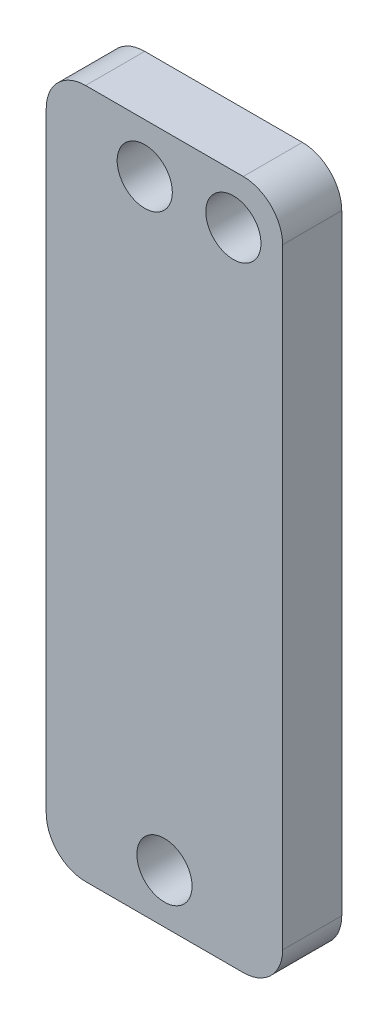
ISO-10303-21;
HEADER;
FILE_DESCRIPTION(('STEP AP214'),'2;1');
FILE_NAME('part.step','',(''),(''),'','','');
FILE_SCHEMA(('AUTOMOTIVE_DESIGN { 1 0 10303 214 1 1 1 1 }'));
ENDSEC;
DATA;
#1=APPLICATION_CONTEXT('core data for automotive mechanical design processes');
#2=APPLICATION_PROTOCOL_DEFINITION('international standard','automotive_design',2000,#1);
#3=PRODUCT_CONTEXT('',#1,'mechanical');
#4=PRODUCT('Part','Part','',(#3));
#5=PRODUCT_RELATED_PRODUCT_CATEGORY('part','',(#4));
#6=PRODUCT_DEFINITION_FORMATION('','',#4);
#7=PRODUCT_DEFINITION_CONTEXT('part definition',#1,'design');
#8=PRODUCT_DEFINITION('design','',#6,#7);
#9=PRODUCT_DEFINITION_SHAPE('','',#8);
#10=(LENGTH_UNIT() NAMED_UNIT(*) SI_UNIT(.MILLI.,.METRE.));
#11=(NAMED_UNIT(*) PLANE_ANGLE_UNIT() SI_UNIT($,.RADIAN.));
#12=(NAMED_UNIT(*) SI_UNIT($,.STERADIAN.) SOLID_ANGLE_UNIT());
#13=UNCERTAINTY_MEASURE_WITH_UNIT(LENGTH_MEASURE(1.E-05),#10,'distance_accuracy_value','');
#14=(GEOMETRIC_REPRESENTATION_CONTEXT(3) GLOBAL_UNCERTAINTY_ASSIGNED_CONTEXT((#13)) GLOBAL_UNIT_ASSIGNED_CONTEXT((#10,
#11,#12)) REPRESENTATION_CONTEXT('',''));
#15=CARTESIAN_POINT('',(0.,0.,0.));
#16=DIRECTION('',(0.,0.,1.));
#17=DIRECTION('',(1.,0.,0.));
#18=AXIS2_PLACEMENT_3D('',#15,#16,#17);
#19=CARTESIAN_POINT('',(0.,0.,3.));
#20=DIRECTION('',(0.,0.,1.));
#21=DIRECTION('',(1.,0.,0.));
#22=AXIS2_PLACEMENT_3D('',#19,#20,#21);
#23=PLANE('',#22);
#24=CARTESIAN_POINT('',(3.50000000000001,15.,3.));
#25=DIRECTION('',(0.,0.,-1.));
#26=DIRECTION('',(-1.,0.,0.));
#27=AXIS2_PLACEMENT_3D('',#24,#25,#26);
#28=CIRCLE('',#27,1.4);
#29=CARTESIAN_POINT('',(2.10000000000001,15.,3.));
#30=VERTEX_POINT('',#29);
#31=EDGE_CURVE('E193',#30,#30,#28,.T.);
#32=ORIENTED_EDGE('',*,*,#31,.T.);
#33=EDGE_LOOP('',(#32));
#34=FACE_BOUND('',#33,.T.);
#35=CARTESIAN_POINT('',(-1.,15.,3.));
#36=DIRECTION('',(0.,0.,1.));
#37=DIRECTION('',(1.,0.,0.));
#38=AXIS2_PLACEMENT_3D('',#35,#36,#37);
#39=CIRCLE('',#38,1.4);
#40=CARTESIAN_POINT('',(0.399999999999996,15.,3.));
#41=VERTEX_POINT('',#40);
#42=EDGE_CURVE('E135',#41,#41,#39,.T.);
#43=ORIENTED_EDGE('',*,*,#42,.F.);
#44=EDGE_LOOP('',(#43));
#45=FACE_BOUND('',#44,.T.);
#46=DIRECTION('',(0.,-1.,0.));
#47=VECTOR('',#46,1.);
#48=CARTESIAN_POINT('',(-5.99999999999999,-17.5,3.));
#49=LINE('',#48,#47);
#50=CARTESIAN_POINT('',(-6.00000000000001,15.5,3.));
#51=VERTEX_POINT('',#50);
#52=CARTESIAN_POINT('',(-5.99999999999999,-15.5,3.));
#53=VERTEX_POINT('',#52);
#54=EDGE_CURVE('E140',#51,#53,#49,.T.);
#55=ORIENTED_EDGE('',*,*,#54,.T.);
#56=CARTESIAN_POINT('',(-3.99999999999999,-15.5,3.));
#57=DIRECTION('',(0.,0.,1.));
#58=DIRECTION('',(1.,0.,0.));
#59=AXIS2_PLACEMENT_3D('',#56,#57,#58);
#60=CIRCLE('',#59,2.);
#61=CARTESIAN_POINT('',(-3.99999999999999,-17.5,3.));
#62=VERTEX_POINT('',#61);
#63=EDGE_CURVE('E155',#53,#62,#60,.T.);
#64=ORIENTED_EDGE('',*,*,#63,.T.);
#65=DIRECTION('',(1.,0.,0.));
#66=VECTOR('',#65,1.);
#67=CARTESIAN_POINT('',(6.00000000000001,-17.5,3.));
#68=LINE('',#67,#66);
#69=CARTESIAN_POINT('',(4.00000000000001,-17.5,3.));
#70=VERTEX_POINT('',#69);
#71=EDGE_CURVE('E122',#62,#70,#68,.T.);
#72=ORIENTED_EDGE('',*,*,#71,.T.);
#73=CARTESIAN_POINT('',(4.00000000000001,-15.5,3.));
#74=DIRECTION('',(0.,0.,1.));
#75=DIRECTION('',(1.,0.,0.));
#76=AXIS2_PLACEMENT_3D('',#73,#74,#75);
#77=CIRCLE('',#76,2.);
#78=CARTESIAN_POINT('',(6.00000000000001,-15.5,3.));
#79=VERTEX_POINT('',#78);
#80=EDGE_CURVE('E153',#70,#79,#77,.T.);
#81=ORIENTED_EDGE('',*,*,#80,.T.);
#82=DIRECTION('',(0.,1.,0.));
#83=VECTOR('',#82,1.);
#84=CARTESIAN_POINT('',(6.00000000000001,-17.5,3.));
#85=LINE('',#84,#83);
#86=CARTESIAN_POINT('',(5.99999999999999,15.5,3.));
#87=VERTEX_POINT('',#86);
#88=EDGE_CURVE('E175',#79,#87,#85,.T.);
#89=ORIENTED_EDGE('',*,*,#88,.T.);
#90=CARTESIAN_POINT('',(3.99999999999999,15.5,3.));
#91=DIRECTION('',(0.,0.,1.));
#92=DIRECTION('',(1.,0.,0.));
#93=AXIS2_PLACEMENT_3D('',#90,#91,#92);
#94=CIRCLE('',#93,2.);
#95=CARTESIAN_POINT('',(3.99999999999999,17.5,3.));
#96=VERTEX_POINT('',#95);
#97=EDGE_CURVE('E57',#87,#96,#94,.T.);
#98=ORIENTED_EDGE('',*,*,#97,.T.);
#99=DIRECTION('',(-1.,0.,0.));
#100=VECTOR('',#99,1.);
#101=CARTESIAN_POINT('',(5.99999999999999,17.5,3.));
#102=LINE('',#101,#100);
#103=CARTESIAN_POINT('',(-4.00000000000001,17.5,3.));
#104=VERTEX_POINT('',#103);
#105=EDGE_CURVE('E141',#96,#104,#102,.T.);
#106=ORIENTED_EDGE('',*,*,#105,.T.);
#107=CARTESIAN_POINT('',(-4.00000000000001,15.5,3.));
#108=DIRECTION('',(0.,0.,1.));
#109=DIRECTION('',(1.,0.,0.));
#110=AXIS2_PLACEMENT_3D('',#107,#108,#109);
#111=CIRCLE('',#110,2.);
#112=EDGE_CURVE('E151',#104,#51,#111,.T.);
#113=ORIENTED_EDGE('',*,*,#112,.T.);
#114=EDGE_LOOP('',(#55,#64,#72,#81,#89,#98,#106,#113));
#115=FACE_BOUND('',#114,.T.);
#116=CARTESIAN_POINT('',(0.,-15.,3.));
#117=DIRECTION('',(0.,0.,1.));
#118=DIRECTION('',(1.,0.,0.));
#119=AXIS2_PLACEMENT_3D('',#116,#117,#118);
#120=CIRCLE('',#119,1.4);
#121=CARTESIAN_POINT('',(1.4,-15.,3.));
#122=VERTEX_POINT('',#121);
#123=EDGE_CURVE('E187',#122,#122,#120,.T.);
#124=ORIENTED_EDGE('',*,*,#123,.F.);
#125=EDGE_LOOP('',(#124));
#126=FACE_BOUND('',#125,.T.);
#127=ADVANCED_FACE('F37',(#34,#45,#115,#126),#23,.T.);
#128=CARTESIAN_POINT('',(0.,0.,0.));
#129=DIRECTION('',(0.,0.,1.));
#130=DIRECTION('',(1.,0.,0.));
#131=AXIS2_PLACEMENT_3D('',#128,#129,#130);
#132=PLANE('',#131);
#133=CARTESIAN_POINT('',(3.50000000000001,15.,0.));
#134=DIRECTION('',(0.,0.,-1.));
#135=DIRECTION('',(-1.,0.,0.));
#136=AXIS2_PLACEMENT_3D('',#133,#134,#135);
#137=CIRCLE('',#136,1.4);
#138=CARTESIAN_POINT('',(2.10000000000001,15.,0.));
#139=VERTEX_POINT('',#138);
#140=EDGE_CURVE('E196',#139,#139,#137,.T.);
#141=ORIENTED_EDGE('',*,*,#140,.F.);
#142=EDGE_LOOP('',(#141));
#143=FACE_BOUND('',#142,.T.);
#144=DIRECTION('',(1.,0.,0.));
#145=VECTOR('',#144,1.);
#146=CARTESIAN_POINT('',(6.00000000000001,-17.5,0.));
#147=LINE('',#146,#145);
#148=CARTESIAN_POINT('',(-3.99999999999999,-17.5,0.));
#149=VERTEX_POINT('',#148);
#150=CARTESIAN_POINT('',(4.00000000000001,-17.5,0.));
#151=VERTEX_POINT('',#150);
#152=EDGE_CURVE('E119',#149,#151,#147,.T.);
#153=ORIENTED_EDGE('',*,*,#152,.F.);
#154=CARTESIAN_POINT('',(-3.99999999999999,-15.5,0.));
#155=DIRECTION('',(0.,0.,1.));
#156=DIRECTION('',(1.,0.,0.));
#157=AXIS2_PLACEMENT_3D('',#154,#155,#156);
#158=CIRCLE('',#157,2.);
#159=CARTESIAN_POINT('',(-5.99999999999999,-15.5,0.));
#160=VERTEX_POINT('',#159);
#161=EDGE_CURVE('E102',#149,#160,#158,.F.);
#162=ORIENTED_EDGE('',*,*,#161,.T.);
#163=DIRECTION('',(0.,-1.,0.));
#164=VECTOR('',#163,1.);
#165=CARTESIAN_POINT('',(-5.99999999999999,-17.5,0.));
#166=LINE('',#165,#164);
#167=CARTESIAN_POINT('',(-6.00000000000001,15.5,0.));
#168=VERTEX_POINT('',#167);
#169=EDGE_CURVE('E130',#168,#160,#166,.T.);
#170=ORIENTED_EDGE('',*,*,#169,.F.);
#171=CARTESIAN_POINT('',(-4.00000000000001,15.5,0.));
#172=DIRECTION('',(0.,0.,1.));
#173=DIRECTION('',(1.,0.,0.));
#174=AXIS2_PLACEMENT_3D('',#171,#172,#173);
#175=CIRCLE('',#174,2.);
#176=CARTESIAN_POINT('',(-4.00000000000001,17.5,0.));
#177=VERTEX_POINT('',#176);
#178=EDGE_CURVE('E144',#168,#177,#175,.F.);
#179=ORIENTED_EDGE('',*,*,#178,.T.);
#180=DIRECTION('',(-1.,0.,0.));
#181=VECTOR('',#180,1.);
#182=CARTESIAN_POINT('',(5.99999999999999,17.5,0.));
#183=LINE('',#182,#181);
#184=CARTESIAN_POINT('',(3.99999999999999,17.5,0.));
#185=VERTEX_POINT('',#184);
#186=EDGE_CURVE('E133',#185,#177,#183,.T.);
#187=ORIENTED_EDGE('',*,*,#186,.F.);
#188=CARTESIAN_POINT('',(3.99999999999999,15.5,0.));
#189=DIRECTION('',(0.,0.,1.));
#190=DIRECTION('',(1.,0.,0.));
#191=AXIS2_PLACEMENT_3D('',#188,#189,#190);
#192=CIRCLE('',#191,2.);
#193=CARTESIAN_POINT('',(5.99999999999999,15.5,0.));
#194=VERTEX_POINT('',#193);
#195=EDGE_CURVE('E123',#185,#194,#192,.F.);
#196=ORIENTED_EDGE('',*,*,#195,.T.);
#197=DIRECTION('',(0.,1.,0.));
#198=VECTOR('',#197,1.);
#199=CARTESIAN_POINT('',(6.00000000000001,-17.5,0.));
#200=LINE('',#199,#198);
#201=CARTESIAN_POINT('',(6.00000000000001,-15.5,0.));
#202=VERTEX_POINT('',#201);
#203=EDGE_CURVE('E129',#202,#194,#200,.T.);
#204=ORIENTED_EDGE('',*,*,#203,.F.);
#205=CARTESIAN_POINT('',(4.00000000000001,-15.5,0.));
#206=DIRECTION('',(0.,0.,1.));
#207=DIRECTION('',(1.,0.,0.));
#208=AXIS2_PLACEMENT_3D('',#205,#206,#207);
#209=CIRCLE('',#208,2.);
#210=EDGE_CURVE('E113',#202,#151,#209,.F.);
#211=ORIENTED_EDGE('',*,*,#210,.T.);
#212=EDGE_LOOP('',(#153,#162,#170,#179,#187,#196,#204,#211));
#213=FACE_BOUND('',#212,.T.);
#214=CARTESIAN_POINT('',(-1.,15.,0.));
#215=DIRECTION('',(0.,0.,1.));
#216=DIRECTION('',(1.,0.,0.));
#217=AXIS2_PLACEMENT_3D('',#214,#215,#216);
#218=CIRCLE('',#217,1.4);
#219=CARTESIAN_POINT('',(0.399999999999996,15.,0.));
#220=VERTEX_POINT('',#219);
#221=EDGE_CURVE('E178',#220,#220,#218,.T.);
#222=ORIENTED_EDGE('',*,*,#221,.T.);
#223=EDGE_LOOP('',(#222));
#224=FACE_BOUND('',#223,.T.);
#225=CARTESIAN_POINT('',(0.,-15.,0.));
#226=DIRECTION('',(0.,0.,1.));
#227=DIRECTION('',(1.,0.,0.));
#228=AXIS2_PLACEMENT_3D('',#225,#226,#227);
#229=CIRCLE('',#228,1.4);
#230=CARTESIAN_POINT('',(1.4,-15.,0.));
#231=VERTEX_POINT('',#230);
#232=EDGE_CURVE('E189',#231,#231,#229,.T.);
#233=ORIENTED_EDGE('',*,*,#232,.T.);
#234=EDGE_LOOP('',(#233));
#235=FACE_BOUND('',#234,.T.);
#236=ADVANCED_FACE('F126',(#143,#213,#224,#235),#132,.F.);
#237=CARTESIAN_POINT('',(-5.99999999999999,-17.5,3.));
#238=DIRECTION('',(1.,0.,0.));
#239=DIRECTION('',(0.,1.,0.));
#240=AXIS2_PLACEMENT_3D('',#237,#238,#239);
#241=PLANE('',#240);
#242=ORIENTED_EDGE('',*,*,#169,.T.);
#243=DIRECTION('',(0.,0.,-1.));
#244=VECTOR('',#243,1.);
#245=CARTESIAN_POINT('',(-5.99999999999999,-15.5,3.));
#246=LINE('',#245,#244);
#247=EDGE_CURVE('E107',#160,#53,#246,.F.);
#248=ORIENTED_EDGE('',*,*,#247,.T.);
#249=ORIENTED_EDGE('',*,*,#54,.F.);
#250=DIRECTION('',(0.,0.,-1.));
#251=VECTOR('',#250,1.);
#252=CARTESIAN_POINT('',(-6.00000000000001,15.5,3.));
#253=LINE('',#252,#251);
#254=EDGE_CURVE('E112',#51,#168,#253,.T.);
#255=ORIENTED_EDGE('',*,*,#254,.T.);
#256=EDGE_LOOP('',(#242,#248,#249,#255));
#257=FACE_BOUND('',#256,.T.);
#258=ADVANCED_FACE('F172',(#257),#241,.F.);
#259=CARTESIAN_POINT('',(6.00000000000001,-17.5,3.));
#260=DIRECTION('',(0.,1.,0.));
#261=DIRECTION('',(-1.,0.,0.));
#262=AXIS2_PLACEMENT_3D('',#259,#260,#261);
#263=PLANE('',#262);
#264=ORIENTED_EDGE('',*,*,#71,.F.);
#265=DIRECTION('',(0.,0.,-1.));
#266=VECTOR('',#265,1.);
#267=CARTESIAN_POINT('',(-3.99999999999999,-17.5,3.));
#268=LINE('',#267,#266);
#269=EDGE_CURVE('E106',#62,#149,#268,.T.);
#270=ORIENTED_EDGE('',*,*,#269,.T.);
#271=ORIENTED_EDGE('',*,*,#152,.T.);
#272=DIRECTION('',(0.,0.,-1.));
#273=VECTOR('',#272,1.);
#274=CARTESIAN_POINT('',(4.00000000000001,-17.5,3.));
#275=LINE('',#274,#273);
#276=EDGE_CURVE('E124',#151,#70,#275,.F.);
#277=ORIENTED_EDGE('',*,*,#276,.T.);
#278=EDGE_LOOP('',(#264,#270,#271,#277));
#279=FACE_BOUND('',#278,.T.);
#280=ADVANCED_FACE('F118',(#279),#263,.F.);
#281=CARTESIAN_POINT('',(6.00000000000001,-17.5,3.));
#282=DIRECTION('',(-1.,0.,0.));
#283=DIRECTION('',(0.,-1.,0.));
#284=AXIS2_PLACEMENT_3D('',#281,#282,#283);
#285=PLANE('',#284);
#286=ORIENTED_EDGE('',*,*,#88,.F.);
#287=DIRECTION('',(0.,0.,-1.));
#288=VECTOR('',#287,1.);
#289=CARTESIAN_POINT('',(6.00000000000001,-15.5,3.));
#290=LINE('',#289,#288);
#291=EDGE_CURVE('E159',#79,#202,#290,.T.);
#292=ORIENTED_EDGE('',*,*,#291,.T.);
#293=ORIENTED_EDGE('',*,*,#203,.T.);
#294=DIRECTION('',(0.,0.,-1.));
#295=VECTOR('',#294,1.);
#296=CARTESIAN_POINT('',(5.99999999999999,15.5,3.));
#297=LINE('',#296,#295);
#298=EDGE_CURVE('E157',#194,#87,#297,.F.);
#299=ORIENTED_EDGE('',*,*,#298,.T.);
#300=EDGE_LOOP('',(#286,#292,#293,#299));
#301=FACE_BOUND('',#300,.T.);
#302=ADVANCED_FACE('F225',(#301),#285,.F.);
#303=CARTESIAN_POINT('',(5.99999999999999,17.5,3.));
#304=DIRECTION('',(0.,-1.,0.));
#305=DIRECTION('',(1.,0.,0.));
#306=AXIS2_PLACEMENT_3D('',#303,#304,#305);
#307=PLANE('',#306);
#308=ORIENTED_EDGE('',*,*,#186,.T.);
#309=DIRECTION('',(0.,0.,-1.));
#310=VECTOR('',#309,1.);
#311=CARTESIAN_POINT('',(-4.00000000000001,17.5,3.));
#312=LINE('',#311,#310);
#313=EDGE_CURVE('E11',#177,#104,#312,.F.);
#314=ORIENTED_EDGE('',*,*,#313,.T.);
#315=ORIENTED_EDGE('',*,*,#105,.F.);
#316=DIRECTION('',(0.,0.,-1.));
#317=VECTOR('',#316,1.);
#318=CARTESIAN_POINT('',(3.99999999999999,17.5,3.));
#319=LINE('',#318,#317);
#320=EDGE_CURVE('E45',#96,#185,#319,.T.);
#321=ORIENTED_EDGE('',*,*,#320,.T.);
#322=EDGE_LOOP('',(#308,#314,#315,#321));
#323=FACE_BOUND('',#322,.T.);
#324=ADVANCED_FACE('F164',(#323),#307,.F.);
#325=CARTESIAN_POINT('',(-1.,15.,3.));
#326=DIRECTION('',(0.,0.,-1.));
#327=DIRECTION('',(-1.,0.,0.));
#328=AXIS2_PLACEMENT_3D('',#325,#326,#327);
#329=CYLINDRICAL_SURFACE('',#328,1.4);
#330=ORIENTED_EDGE('',*,*,#42,.T.);
#331=EDGE_LOOP('',(#330));
#332=FACE_BOUND('',#331,.T.);
#333=ORIENTED_EDGE('',*,*,#221,.F.);
#334=EDGE_LOOP('',(#333));
#335=FACE_BOUND('',#334,.T.);
#336=ADVANCED_FACE('F201',(#332,#335),#329,.F.);
#337=CARTESIAN_POINT('',(0.,-15.,3.));
#338=DIRECTION('',(0.,0.,-1.));
#339=DIRECTION('',(-1.,0.,0.));
#340=AXIS2_PLACEMENT_3D('',#337,#338,#339);
#341=CYLINDRICAL_SURFACE('',#340,1.4);
#342=ORIENTED_EDGE('',*,*,#123,.T.);
#343=EDGE_LOOP('',(#342));
#344=FACE_BOUND('',#343,.T.);
#345=ORIENTED_EDGE('',*,*,#232,.F.);
#346=EDGE_LOOP('',(#345));
#347=FACE_BOUND('',#346,.T.);
#348=ADVANCED_FACE('F205',(#344,#347),#341,.F.);
#349=CARTESIAN_POINT('',(3.50000000000001,15.,3.));
#350=DIRECTION('',(0.,0.,-1.));
#351=DIRECTION('',(-1.,0.,0.));
#352=AXIS2_PLACEMENT_3D('',#349,#350,#351);
#353=CYLINDRICAL_SURFACE('',#352,1.4);
#354=ORIENTED_EDGE('',*,*,#31,.F.);
#355=EDGE_LOOP('',(#354));
#356=FACE_BOUND('',#355,.T.);
#357=ORIENTED_EDGE('',*,*,#140,.T.);
#358=EDGE_LOOP('',(#357));
#359=FACE_BOUND('',#358,.T.);
#360=ADVANCED_FACE('F215',(#356,#359),#353,.F.);
#361=CARTESIAN_POINT('',(-3.99999999999999,-15.5,3.));
#362=DIRECTION('',(0.,0.,-1.));
#363=DIRECTION('',(-1.,0.,0.));
#364=AXIS2_PLACEMENT_3D('',#361,#362,#363);
#365=CYLINDRICAL_SURFACE('',#364,2.);
#366=ORIENTED_EDGE('',*,*,#63,.F.);
#367=ORIENTED_EDGE('',*,*,#247,.F.);
#368=ORIENTED_EDGE('',*,*,#161,.F.);
#369=ORIENTED_EDGE('',*,*,#269,.F.);
#370=EDGE_LOOP('',(#366,#367,#368,#369));
#371=FACE_BOUND('',#370,.T.);
#372=ADVANCED_FACE('F105',(#371),#365,.T.);
#373=CARTESIAN_POINT('',(4.00000000000001,-15.5,3.));
#374=DIRECTION('',(0.,0.,-1.));
#375=DIRECTION('',(-1.,0.,0.));
#376=AXIS2_PLACEMENT_3D('',#373,#374,#375);
#377=CYLINDRICAL_SURFACE('',#376,2.);
#378=ORIENTED_EDGE('',*,*,#80,.F.);
#379=ORIENTED_EDGE('',*,*,#276,.F.);
#380=ORIENTED_EDGE('',*,*,#210,.F.);
#381=ORIENTED_EDGE('',*,*,#291,.F.);
#382=EDGE_LOOP('',(#378,#379,#380,#381));
#383=FACE_BOUND('',#382,.T.);
#384=ADVANCED_FACE('F235',(#383),#377,.T.);
#385=CARTESIAN_POINT('',(-4.00000000000001,15.5,3.));
#386=DIRECTION('',(0.,0.,-1.));
#387=DIRECTION('',(-1.,0.,0.));
#388=AXIS2_PLACEMENT_3D('',#385,#386,#387);
#389=CYLINDRICAL_SURFACE('',#388,2.);
#390=ORIENTED_EDGE('',*,*,#112,.F.);
#391=ORIENTED_EDGE('',*,*,#313,.F.);
#392=ORIENTED_EDGE('',*,*,#178,.F.);
#393=ORIENTED_EDGE('',*,*,#254,.F.);
#394=EDGE_LOOP('',(#390,#391,#392,#393));
#395=FACE_BOUND('',#394,.T.);
#396=ADVANCED_FACE('F169',(#395),#389,.T.);
#397=CARTESIAN_POINT('',(3.99999999999999,15.5,3.));
#398=DIRECTION('',(0.,0.,-1.));
#399=DIRECTION('',(-1.,0.,0.));
#400=AXIS2_PLACEMENT_3D('',#397,#398,#399);
#401=CYLINDRICAL_SURFACE('',#400,2.);
#402=ORIENTED_EDGE('',*,*,#97,.F.);
#403=ORIENTED_EDGE('',*,*,#298,.F.);
#404=ORIENTED_EDGE('',*,*,#195,.F.);
#405=ORIENTED_EDGE('',*,*,#320,.F.);
#406=EDGE_LOOP('',(#402,#403,#404,#405));
#407=FACE_BOUND('',#406,.T.);
#408=ADVANCED_FACE('F39',(#407),#401,.T.);
#409=CLOSED_SHELL('',(#127,#236,#258,#280,#302,#324,#336,#348,#360,#372,#384,#396,#408));
#410=MANIFOLD_SOLID_BREP('B2',#409);
#411=ADVANCED_BREP_SHAPE_REPRESENTATION('',(#18,#410),#14);
#412=SHAPE_DEFINITION_REPRESENTATION(#9,#411);
ENDSEC;
END-ISO-10303-21;
